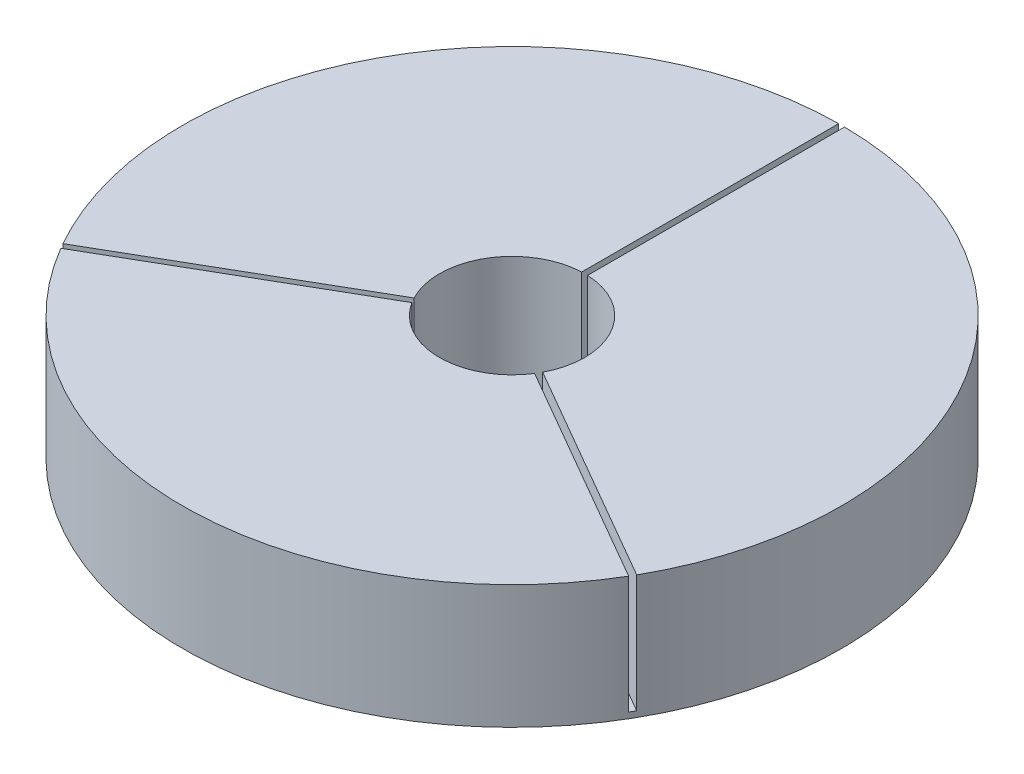
ISO-10303-21;
HEADER;
FILE_DESCRIPTION(('STEP AP214'),'2;1');
FILE_NAME('part.step','',(''),(''),'','','');
FILE_SCHEMA(('AUTOMOTIVE_DESIGN { 1 0 10303 214 1 1 1 1 }'));
ENDSEC;
DATA;
#1=APPLICATION_CONTEXT('core data for automotive mechanical design processes');
#2=APPLICATION_PROTOCOL_DEFINITION('international standard','automotive_design',2000,#1);
#3=PRODUCT_CONTEXT('',#1,'mechanical');
#4=PRODUCT('Part','Part','',(#3));
#5=PRODUCT_RELATED_PRODUCT_CATEGORY('part','',(#4));
#6=PRODUCT_DEFINITION_FORMATION('','',#4);
#7=PRODUCT_DEFINITION_CONTEXT('part definition',#1,'design');
#8=PRODUCT_DEFINITION('design','',#6,#7);
#9=PRODUCT_DEFINITION_SHAPE('','',#8);
#10=(LENGTH_UNIT() NAMED_UNIT(*) SI_UNIT(.MILLI.,.METRE.));
#11=(NAMED_UNIT(*) PLANE_ANGLE_UNIT() SI_UNIT($,.RADIAN.));
#12=(NAMED_UNIT(*) SI_UNIT($,.STERADIAN.) SOLID_ANGLE_UNIT());
#13=UNCERTAINTY_MEASURE_WITH_UNIT(LENGTH_MEASURE(1.E-05),#10,'distance_accuracy_value','');
#14=(GEOMETRIC_REPRESENTATION_CONTEXT(3) GLOBAL_UNCERTAINTY_ASSIGNED_CONTEXT((#13)) GLOBAL_UNIT_ASSIGNED_CONTEXT((#10,
#11,#12)) REPRESENTATION_CONTEXT('',''));
#15=CARTESIAN_POINT('',(0.,0.,0.));
#16=DIRECTION('',(0.,0.,1.));
#17=DIRECTION('',(1.,0.,0.));
#18=AXIS2_PLACEMENT_3D('',#15,#16,#17);
#19=CARTESIAN_POINT('',(0.,0.,0.));
#20=DIRECTION('',(0.,-1.,0.));
#21=DIRECTION('',(0.,0.,-1.));
#22=AXIS2_PLACEMENT_3D('',#19,#20,#21);
#23=PLANE('',#22);
#24=CARTESIAN_POINT('',(0.,0.,0.));
#25=DIRECTION('',(0.,-1.,0.));
#26=DIRECTION('',(0.,0.,-1.));
#27=AXIS2_PLACEMENT_3D('',#24,#25,#26);
#28=CIRCLE('',#27,355.614173824666);
#29=CARTESIAN_POINT('',(-306.371133585748,0.,180.549630657013));
#30=VERTEX_POINT('',#29);
#31=CARTESIAN_POINT('',(-309.546133585748,0.,175.050369342982));
#32=VERTEX_POINT('',#31);
#33=EDGE_CURVE('E263',#30,#32,#28,.T.);
#34=ORIENTED_EDGE('',*,*,#33,.F.);
#35=DIRECTION('',(0.866025403784443,0.,-0.499999999999992));
#36=VECTOR('',#35,1.);
#37=CARTESIAN_POINT('',(1.58749999999998,0.,2.74963065701562));
#38=LINE('',#37,#36);
#39=CARTESIAN_POINT('',(-66.2176560871299,0.,41.8969557763638));
#40=VERTEX_POINT('',#39);
#41=EDGE_CURVE('E105',#30,#40,#38,.T.);
#42=ORIENTED_EDGE('',*,*,#41,.T.);
#43=CARTESIAN_POINT('',(0.,0.,0.));
#44=DIRECTION('',(0.,1.,0.));
#45=DIRECTION('',(0.,0.,1.));
#46=AXIS2_PLACEMENT_3D('',#43,#44,#45);
#47=CIRCLE('',#46,78.359);
#48=CARTESIAN_POINT('',(66.2176560871294,0.,41.8969557763647));
#49=VERTEX_POINT('',#48);
#50=EDGE_CURVE('E204',#40,#49,#47,.T.);
#51=ORIENTED_EDGE('',*,*,#50,.T.);
#52=DIRECTION('',(-0.866025403784436,0.,-0.500000000000004));
#53=VECTOR('',#52,1.);
#54=CARTESIAN_POINT('',(-1.58750000000002,0.,2.7496306570156));
#55=LINE('',#54,#53);
#56=CARTESIAN_POINT('',(306.371133585746,0.,180.549630657017));
#57=VERTEX_POINT('',#56);
#58=EDGE_CURVE('E208',#57,#49,#55,.T.);
#59=ORIENTED_EDGE('',*,*,#58,.F.);
#60=CARTESIAN_POINT('',(309.546133585746,0.,175.050369342986));
#61=VERTEX_POINT('',#60);
#62=EDGE_CURVE('E273',#61,#57,#28,.T.);
#63=ORIENTED_EDGE('',*,*,#62,.F.);
#64=DIRECTION('',(-0.866025403784436,0.,-0.500000000000004));
#65=VECTOR('',#64,1.);
#66=CARTESIAN_POINT('',(1.5875,0.,-2.74963065701557));
#67=LINE('',#66,#65);
#68=CARTESIAN_POINT('',(69.3926560871294,0.,36.3976944623336));
#69=VERTEX_POINT('',#68);
#70=EDGE_CURVE('E187',#61,#69,#67,.T.);
#71=ORIENTED_EDGE('',*,*,#70,.T.);
#72=CARTESIAN_POINT('',(0.,0.,0.));
#73=DIRECTION('',(0.,1.,0.));
#74=DIRECTION('',(0.,0.,1.));
#75=AXIS2_PLACEMENT_3D('',#72,#73,#74);
#76=CIRCLE('',#75,78.359);
#77=CARTESIAN_POINT('',(3.17499999999998,0.,-78.2946502386977));
#78=VERTEX_POINT('',#77);
#79=EDGE_CURVE('E233',#69,#78,#76,.T.);
#80=ORIENTED_EDGE('',*,*,#79,.T.);
#81=DIRECTION('',(0.,0.,1.));
#82=VECTOR('',#81,1.);
#83=CARTESIAN_POINT('',(3.175,0.,0.));
#84=LINE('',#83,#82);
#85=CARTESIAN_POINT('',(3.17499999999989,0.,-355.6));
#86=VERTEX_POINT('',#85);
#87=EDGE_CURVE('E113',#86,#78,#84,.T.);
#88=ORIENTED_EDGE('',*,*,#87,.F.);
#89=CARTESIAN_POINT('',(-3.17500000000011,0.,-355.6));
#90=VERTEX_POINT('',#89);
#91=EDGE_CURVE('E269',#90,#86,#28,.T.);
#92=ORIENTED_EDGE('',*,*,#91,.F.);
#93=DIRECTION('',(0.,0.,1.));
#94=VECTOR('',#93,1.);
#95=CARTESIAN_POINT('',(-3.175,0.,0.));
#96=LINE('',#95,#94);
#97=CARTESIAN_POINT('',(-3.17500000000002,0.,-78.2946502386977));
#98=VERTEX_POINT('',#97);
#99=EDGE_CURVE('E268',#90,#98,#96,.T.);
#100=ORIENTED_EDGE('',*,*,#99,.T.);
#101=CARTESIAN_POINT('',(0.,0.,0.));
#102=DIRECTION('',(0.,1.,0.));
#103=DIRECTION('',(0.,0.,1.));
#104=AXIS2_PLACEMENT_3D('',#101,#102,#103);
#105=CIRCLE('',#104,78.359);
#106=CARTESIAN_POINT('',(-69.3926560871299,0.,36.3976944623326));
#107=VERTEX_POINT('',#106);
#108=EDGE_CURVE('E279',#98,#107,#105,.T.);
#109=ORIENTED_EDGE('',*,*,#108,.T.);
#110=DIRECTION('',(0.866025403784443,0.,-0.499999999999992));
#111=VECTOR('',#110,1.);
#112=CARTESIAN_POINT('',(-1.58749999999998,0.,-2.74963065701562));
#113=LINE('',#112,#111);
#114=EDGE_CURVE('E292',#32,#107,#113,.T.);
#115=ORIENTED_EDGE('',*,*,#114,.F.);
#116=EDGE_LOOP('',(#34,#42,#51,#59,#63,#71,#80,#88,#92,#100,#109,#115));
#117=FACE_BOUND('',#116,.T.);
#118=ADVANCED_FACE('F89',(#117),#23,.F.);
#119=CARTESIAN_POINT('',(-3.175,127.,0.));
#120=DIRECTION('',(1.,0.,0.));
#121=DIRECTION('',(0.,0.,-1.));
#122=AXIS2_PLACEMENT_3D('',#119,#120,#121);
#123=PLANE('',#122);
#124=ORIENTED_EDGE('',*,*,#99,.F.);
#125=DIRECTION('',(0.,-1.,0.));
#126=VECTOR('',#125,1.);
#127=CARTESIAN_POINT('',(-3.17500000000011,127.,-355.6));
#128=LINE('',#127,#126);
#129=CARTESIAN_POINT('',(-3.17500000000011,127.,-355.6));
#130=VERTEX_POINT('',#129);
#131=EDGE_CURVE('E12',#130,#90,#128,.T.);
#132=ORIENTED_EDGE('',*,*,#131,.F.);
#133=DIRECTION('',(0.,0.,1.));
#134=VECTOR('',#133,1.);
#135=CARTESIAN_POINT('',(-3.175,127.,0.));
#136=LINE('',#135,#134);
#137=CARTESIAN_POINT('',(-3.17500000000002,127.,-78.2946502386977));
#138=VERTEX_POINT('',#137);
#139=EDGE_CURVE('E274',#130,#138,#136,.T.);
#140=ORIENTED_EDGE('',*,*,#139,.T.);
#141=DIRECTION('',(0.,-1.,0.));
#142=VECTOR('',#141,1.);
#143=CARTESIAN_POINT('',(-3.17500000000002,127.,-78.2946502386977));
#144=LINE('',#143,#142);
#145=EDGE_CURVE('E289',#138,#98,#144,.T.);
#146=ORIENTED_EDGE('',*,*,#145,.T.);
#147=EDGE_LOOP('',(#124,#132,#140,#146));
#148=FACE_BOUND('',#147,.T.);
#149=ADVANCED_FACE('F91',(#148),#123,.T.);
#150=CARTESIAN_POINT('',(0.,127.,0.));
#151=DIRECTION('',(0.,-1.,0.));
#152=DIRECTION('',(0.,0.,-1.));
#153=AXIS2_PLACEMENT_3D('',#150,#151,#152);
#154=CYLINDRICAL_SURFACE('',#153,355.614173824666);
#155=ORIENTED_EDGE('',*,*,#131,.T.);
#156=ORIENTED_EDGE('',*,*,#91,.T.);
#157=DIRECTION('',(0.,-1.,0.));
#158=VECTOR('',#157,1.);
#159=CARTESIAN_POINT('',(3.17499999999989,127.,-355.6));
#160=LINE('',#159,#158);
#161=CARTESIAN_POINT('',(3.17499999999989,127.,-355.6));
#162=VERTEX_POINT('',#161);
#163=EDGE_CURVE('E257',#162,#86,#160,.T.);
#164=ORIENTED_EDGE('',*,*,#163,.F.);
#165=CARTESIAN_POINT('',(0.,127.,0.));
#166=DIRECTION('',(0.,1.,0.));
#167=DIRECTION('',(0.,0.,1.));
#168=AXIS2_PLACEMENT_3D('',#165,#166,#167);
#169=CIRCLE('',#168,355.614173824666);
#170=CARTESIAN_POINT('',(309.546133585746,127.,175.050369342986));
#171=VERTEX_POINT('',#170);
#172=EDGE_CURVE('E232',#171,#162,#169,.T.);
#173=ORIENTED_EDGE('',*,*,#172,.F.);
#174=DIRECTION('',(0.,-1.,0.));
#175=VECTOR('',#174,1.);
#176=CARTESIAN_POINT('',(309.546133585746,127.,175.050369342986));
#177=LINE('',#176,#175);
#178=EDGE_CURVE('E260',#171,#61,#177,.T.);
#179=ORIENTED_EDGE('',*,*,#178,.T.);
#180=ORIENTED_EDGE('',*,*,#62,.T.);
#181=DIRECTION('',(0.,-1.,0.));
#182=VECTOR('',#181,1.);
#183=CARTESIAN_POINT('',(306.371133585746,127.,180.549630657017));
#184=LINE('',#183,#182);
#185=CARTESIAN_POINT('',(306.371133585746,127.,180.549630657017));
#186=VERTEX_POINT('',#185);
#187=EDGE_CURVE('E188',#186,#57,#184,.T.);
#188=ORIENTED_EDGE('',*,*,#187,.F.);
#189=CARTESIAN_POINT('',(0.,127.,0.));
#190=DIRECTION('',(0.,1.,0.));
#191=DIRECTION('',(0.,0.,1.));
#192=AXIS2_PLACEMENT_3D('',#189,#190,#191);
#193=CIRCLE('',#192,355.614173824666);
#194=CARTESIAN_POINT('',(-306.371133585748,127.,180.549630657013));
#195=VERTEX_POINT('',#194);
#196=EDGE_CURVE('E191',#195,#186,#193,.T.);
#197=ORIENTED_EDGE('',*,*,#196,.F.);
#198=DIRECTION('',(0.,-1.,0.));
#199=VECTOR('',#198,1.);
#200=CARTESIAN_POINT('',(-306.371133585748,127.,180.549630657013));
#201=LINE('',#200,#199);
#202=EDGE_CURVE('E178',#195,#30,#201,.T.);
#203=ORIENTED_EDGE('',*,*,#202,.T.);
#204=ORIENTED_EDGE('',*,*,#33,.T.);
#205=DIRECTION('',(0.,-1.,0.));
#206=VECTOR('',#205,1.);
#207=CARTESIAN_POINT('',(-309.546133585748,127.,175.050369342982));
#208=LINE('',#207,#206);
#209=CARTESIAN_POINT('',(-309.546133585748,127.,175.050369342982));
#210=VERTEX_POINT('',#209);
#211=EDGE_CURVE('E98',#210,#32,#208,.T.);
#212=ORIENTED_EDGE('',*,*,#211,.F.);
#213=CARTESIAN_POINT('',(0.,127.,0.));
#214=DIRECTION('',(0.,1.,0.));
#215=DIRECTION('',(0.,0.,1.));
#216=AXIS2_PLACEMENT_3D('',#213,#214,#215);
#217=CIRCLE('',#216,355.614173824666);
#218=EDGE_CURVE('E278',#130,#210,#217,.T.);
#219=ORIENTED_EDGE('',*,*,#218,.F.);
#220=EDGE_LOOP('',(#155,#156,#164,#173,#179,#180,#188,#197,#203,#204,#212,#219));
#221=FACE_BOUND('',#220,.T.);
#222=CARTESIAN_POINT('',(0.,-6.35,0.));
#223=DIRECTION('',(0.,-1.,0.));
#224=DIRECTION('',(0.,0.,-1.));
#225=AXIS2_PLACEMENT_3D('',#222,#223,#224);
#226=CIRCLE('',#225,355.614173824666);
#227=CARTESIAN_POINT('',(0.,-6.35,-355.614173824666));
#228=VERTEX_POINT('',#227);
#229=EDGE_CURVE('E264',#228,#228,#226,.T.);
#230=ORIENTED_EDGE('',*,*,#229,.F.);
#231=EDGE_LOOP('',(#230));
#232=FACE_BOUND('',#231,.T.);
#233=ADVANCED_FACE('F192',(#221,#232),#154,.T.);
#234=CARTESIAN_POINT('',(-1.58749999999998,127.,-2.74963065701562));
#235=DIRECTION('',(-0.499999999999992,0.,-0.866025403784443));
#236=DIRECTION('',(-0.866025403784443,0.,0.499999999999992));
#237=AXIS2_PLACEMENT_3D('',#234,#235,#236);
#238=PLANE('',#237);
#239=ORIENTED_EDGE('',*,*,#114,.T.);
#240=DIRECTION('',(0.,-1.,0.));
#241=VECTOR('',#240,1.);
#242=CARTESIAN_POINT('',(-69.3926560871299,127.,36.3976944623326));
#243=LINE('',#242,#241);
#244=CARTESIAN_POINT('',(-69.3926560871299,127.,36.3976944623326));
#245=VERTEX_POINT('',#244);
#246=EDGE_CURVE('E301',#245,#107,#243,.T.);
#247=ORIENTED_EDGE('',*,*,#246,.F.);
#248=DIRECTION('',(0.866025403784443,0.,-0.499999999999992));
#249=VECTOR('',#248,1.);
#250=CARTESIAN_POINT('',(-1.58749999999998,127.,-2.74963065701562));
#251=LINE('',#250,#249);
#252=EDGE_CURVE('E282',#210,#245,#251,.T.);
#253=ORIENTED_EDGE('',*,*,#252,.F.);
#254=ORIENTED_EDGE('',*,*,#211,.T.);
#255=EDGE_LOOP('',(#239,#247,#253,#254));
#256=FACE_BOUND('',#255,.T.);
#257=ADVANCED_FACE('F309',(#256),#238,.F.);
#258=CARTESIAN_POINT('',(0.,127.,0.));
#259=DIRECTION('',(0.,-1.,0.));
#260=DIRECTION('',(0.,0.,-1.));
#261=AXIS2_PLACEMENT_3D('',#258,#259,#260);
#262=CYLINDRICAL_SURFACE('',#261,78.359);
#263=ORIENTED_EDGE('',*,*,#108,.F.);
#264=ORIENTED_EDGE('',*,*,#145,.F.);
#265=CARTESIAN_POINT('',(0.,127.,0.));
#266=DIRECTION('',(0.,1.,0.));
#267=DIRECTION('',(0.,0.,1.));
#268=AXIS2_PLACEMENT_3D('',#265,#266,#267);
#269=CIRCLE('',#268,78.359);
#270=EDGE_CURVE('E285',#138,#245,#269,.T.);
#271=ORIENTED_EDGE('',*,*,#270,.T.);
#272=ORIENTED_EDGE('',*,*,#246,.T.);
#273=EDGE_LOOP('',(#263,#264,#271,#272));
#274=FACE_BOUND('',#273,.T.);
#275=ADVANCED_FACE('F319',(#274),#262,.F.);
#276=CARTESIAN_POINT('',(0.,127.,0.));
#277=DIRECTION('',(0.,1.,0.));
#278=DIRECTION('',(0.,0.,1.));
#279=AXIS2_PLACEMENT_3D('',#276,#277,#278);
#280=PLANE('',#279);
#281=ORIENTED_EDGE('',*,*,#139,.F.);
#282=ORIENTED_EDGE('',*,*,#218,.T.);
#283=ORIENTED_EDGE('',*,*,#252,.T.);
#284=ORIENTED_EDGE('',*,*,#270,.F.);
#285=EDGE_LOOP('',(#281,#282,#283,#284));
#286=FACE_BOUND('',#285,.T.);
#287=ADVANCED_FACE('F322',(#286),#280,.T.);
#288=CARTESIAN_POINT('',(0.,-6.35,0.));
#289=DIRECTION('',(0.,-1.,0.));
#290=DIRECTION('',(0.,0.,-1.));
#291=AXIS2_PLACEMENT_3D('',#288,#289,#290);
#292=PLANE('',#291);
#293=ORIENTED_EDGE('',*,*,#229,.T.);
#294=EDGE_LOOP('',(#293));
#295=FACE_BOUND('',#294,.T.);
#296=ADVANCED_FACE('F362',(#295),#292,.T.);
#297=CARTESIAN_POINT('',(1.5875,127.,-2.74963065701557));
#298=DIRECTION('',(-0.500000000000004,0.,0.866025403784436));
#299=DIRECTION('',(0.866025403784436,0.,0.500000000000004));
#300=AXIS2_PLACEMENT_3D('',#297,#298,#299);
#301=PLANE('',#300);
#302=ORIENTED_EDGE('',*,*,#70,.F.);
#303=ORIENTED_EDGE('',*,*,#178,.F.);
#304=DIRECTION('',(-0.866025403784436,0.,-0.500000000000004));
#305=VECTOR('',#304,1.);
#306=CARTESIAN_POINT('',(1.5875,127.,-2.74963065701557));
#307=LINE('',#306,#305);
#308=CARTESIAN_POINT('',(69.3926560871294,127.,36.3976944623336));
#309=VERTEX_POINT('',#308);
#310=EDGE_CURVE('E228',#171,#309,#307,.T.);
#311=ORIENTED_EDGE('',*,*,#310,.T.);
#312=DIRECTION('',(0.,-1.,0.));
#313=VECTOR('',#312,1.);
#314=CARTESIAN_POINT('',(69.3926560871294,127.,36.3976944623336));
#315=LINE('',#314,#313);
#316=EDGE_CURVE('E243',#309,#69,#315,.T.);
#317=ORIENTED_EDGE('',*,*,#316,.T.);
#318=EDGE_LOOP('',(#302,#303,#311,#317));
#319=FACE_BOUND('',#318,.T.);
#320=ADVANCED_FACE('F338',(#319),#301,.T.);
#321=CARTESIAN_POINT('',(3.175,127.,0.));
#322=DIRECTION('',(1.,0.,0.));
#323=DIRECTION('',(0.,0.,-1.));
#324=AXIS2_PLACEMENT_3D('',#321,#322,#323);
#325=PLANE('',#324);
#326=ORIENTED_EDGE('',*,*,#87,.T.);
#327=DIRECTION('',(0.,-1.,0.));
#328=VECTOR('',#327,1.);
#329=CARTESIAN_POINT('',(3.17499999999998,127.,-78.2946502386977));
#330=LINE('',#329,#328);
#331=CARTESIAN_POINT('',(3.17499999999998,127.,-78.2946502386977));
#332=VERTEX_POINT('',#331);
#333=EDGE_CURVE('E254',#332,#78,#330,.T.);
#334=ORIENTED_EDGE('',*,*,#333,.F.);
#335=DIRECTION('',(0.,0.,1.));
#336=VECTOR('',#335,1.);
#337=CARTESIAN_POINT('',(3.175,127.,0.));
#338=LINE('',#337,#336);
#339=EDGE_CURVE('E236',#162,#332,#338,.T.);
#340=ORIENTED_EDGE('',*,*,#339,.F.);
#341=ORIENTED_EDGE('',*,*,#163,.T.);
#342=EDGE_LOOP('',(#326,#334,#340,#341));
#343=FACE_BOUND('',#342,.T.);
#344=ADVANCED_FACE('F333',(#343),#325,.F.);
#345=CARTESIAN_POINT('',(0.,127.,0.));
#346=DIRECTION('',(0.,-1.,0.));
#347=DIRECTION('',(0.,0.,-1.));
#348=AXIS2_PLACEMENT_3D('',#345,#346,#347);
#349=CYLINDRICAL_SURFACE('',#348,78.359);
#350=ORIENTED_EDGE('',*,*,#79,.F.);
#351=ORIENTED_EDGE('',*,*,#316,.F.);
#352=CARTESIAN_POINT('',(0.,127.,0.));
#353=DIRECTION('',(0.,1.,0.));
#354=DIRECTION('',(0.,0.,1.));
#355=AXIS2_PLACEMENT_3D('',#352,#353,#354);
#356=CIRCLE('',#355,78.359);
#357=EDGE_CURVE('E239',#309,#332,#356,.T.);
#358=ORIENTED_EDGE('',*,*,#357,.T.);
#359=ORIENTED_EDGE('',*,*,#333,.T.);
#360=EDGE_LOOP('',(#350,#351,#358,#359));
#361=FACE_BOUND('',#360,.T.);
#362=ADVANCED_FACE('F331',(#361),#349,.F.);
#363=CARTESIAN_POINT('',(0.,127.,0.));
#364=DIRECTION('',(0.,1.,0.));
#365=DIRECTION('',(0.,0.,1.));
#366=AXIS2_PLACEMENT_3D('',#363,#364,#365);
#367=PLANE('',#366);
#368=ORIENTED_EDGE('',*,*,#310,.F.);
#369=ORIENTED_EDGE('',*,*,#172,.T.);
#370=ORIENTED_EDGE('',*,*,#339,.T.);
#371=ORIENTED_EDGE('',*,*,#357,.F.);
#372=EDGE_LOOP('',(#368,#369,#370,#371));
#373=FACE_BOUND('',#372,.T.);
#374=ADVANCED_FACE('F336',(#373),#367,.T.);
#375=CARTESIAN_POINT('',(1.58749999999998,127.,2.74963065701562));
#376=DIRECTION('',(-0.499999999999992,0.,-0.866025403784443));
#377=DIRECTION('',(-0.866025403784443,0.,0.499999999999992));
#378=AXIS2_PLACEMENT_3D('',#375,#376,#377);
#379=PLANE('',#378);
#380=ORIENTED_EDGE('',*,*,#41,.F.);
#381=ORIENTED_EDGE('',*,*,#202,.F.);
#382=DIRECTION('',(0.866025403784443,0.,-0.499999999999992));
#383=VECTOR('',#382,1.);
#384=CARTESIAN_POINT('',(1.58749999999998,127.,2.74963065701562));
#385=LINE('',#384,#383);
#386=CARTESIAN_POINT('',(-66.2176560871299,127.,41.8969557763638));
#387=VERTEX_POINT('',#386);
#388=EDGE_CURVE('E182',#195,#387,#385,.T.);
#389=ORIENTED_EDGE('',*,*,#388,.T.);
#390=DIRECTION('',(0.,-1.,0.));
#391=VECTOR('',#390,1.);
#392=CARTESIAN_POINT('',(-66.2176560871299,127.,41.8969557763638));
#393=LINE('',#392,#391);
#394=EDGE_CURVE('E215',#387,#40,#393,.T.);
#395=ORIENTED_EDGE('',*,*,#394,.T.);
#396=EDGE_LOOP('',(#380,#381,#389,#395));
#397=FACE_BOUND('',#396,.T.);
#398=ADVANCED_FACE('F180',(#397),#379,.T.);
#399=CARTESIAN_POINT('',(-1.58750000000002,127.,2.7496306570156));
#400=DIRECTION('',(-0.500000000000004,0.,0.866025403784436));
#401=DIRECTION('',(0.866025403784436,0.,0.500000000000004));
#402=AXIS2_PLACEMENT_3D('',#399,#400,#401);
#403=PLANE('',#402);
#404=ORIENTED_EDGE('',*,*,#58,.T.);
#405=DIRECTION('',(0.,-1.,0.));
#406=VECTOR('',#405,1.);
#407=CARTESIAN_POINT('',(66.2176560871294,127.,41.8969557763647));
#408=LINE('',#407,#406);
#409=CARTESIAN_POINT('',(66.2176560871294,127.,41.8969557763647));
#410=VERTEX_POINT('',#409);
#411=EDGE_CURVE('E223',#410,#49,#408,.T.);
#412=ORIENTED_EDGE('',*,*,#411,.F.);
#413=DIRECTION('',(-0.866025403784436,0.,-0.500000000000004));
#414=VECTOR('',#413,1.);
#415=CARTESIAN_POINT('',(-1.58750000000002,127.,2.7496306570156));
#416=LINE('',#415,#414);
#417=EDGE_CURVE('E198',#186,#410,#416,.T.);
#418=ORIENTED_EDGE('',*,*,#417,.F.);
#419=ORIENTED_EDGE('',*,*,#187,.T.);
#420=EDGE_LOOP('',(#404,#412,#418,#419));
#421=FACE_BOUND('',#420,.T.);
#422=ADVANCED_FACE('F344',(#421),#403,.F.);
#423=CARTESIAN_POINT('',(0.,127.,0.));
#424=DIRECTION('',(0.,-1.,0.));
#425=DIRECTION('',(0.,0.,-1.));
#426=AXIS2_PLACEMENT_3D('',#423,#424,#425);
#427=CYLINDRICAL_SURFACE('',#426,78.359);
#428=ORIENTED_EDGE('',*,*,#50,.F.);
#429=ORIENTED_EDGE('',*,*,#394,.F.);
#430=CARTESIAN_POINT('',(0.,127.,0.));
#431=DIRECTION('',(0.,1.,0.));
#432=DIRECTION('',(0.,0.,1.));
#433=AXIS2_PLACEMENT_3D('',#430,#431,#432);
#434=CIRCLE('',#433,78.359);
#435=EDGE_CURVE('E202',#387,#410,#434,.T.);
#436=ORIENTED_EDGE('',*,*,#435,.T.);
#437=ORIENTED_EDGE('',*,*,#411,.T.);
#438=EDGE_LOOP('',(#428,#429,#436,#437));
#439=FACE_BOUND('',#438,.T.);
#440=ADVANCED_FACE('F346',(#439),#427,.F.);
#441=CARTESIAN_POINT('',(0.,127.,0.));
#442=DIRECTION('',(0.,1.,0.));
#443=DIRECTION('',(0.,0.,1.));
#444=AXIS2_PLACEMENT_3D('',#441,#442,#443);
#445=PLANE('',#444);
#446=ORIENTED_EDGE('',*,*,#388,.F.);
#447=ORIENTED_EDGE('',*,*,#196,.T.);
#448=ORIENTED_EDGE('',*,*,#417,.T.);
#449=ORIENTED_EDGE('',*,*,#435,.F.);
#450=EDGE_LOOP('',(#446,#447,#448,#449));
#451=FACE_BOUND('',#450,.T.);
#452=ADVANCED_FACE('F200',(#451),#445,.T.);
#453=CLOSED_SHELL('',(#118,#149,#233,#257,#275,#287,#296,#320,#344,#362,#374,#398,#422,#440,#452));
#454=MANIFOLD_SOLID_BREP('B2',#453);
#455=ADVANCED_BREP_SHAPE_REPRESENTATION('',(#18,#454),#14);
#456=SHAPE_DEFINITION_REPRESENTATION(#9,#455);
ENDSEC;
END-ISO-10303-21;
